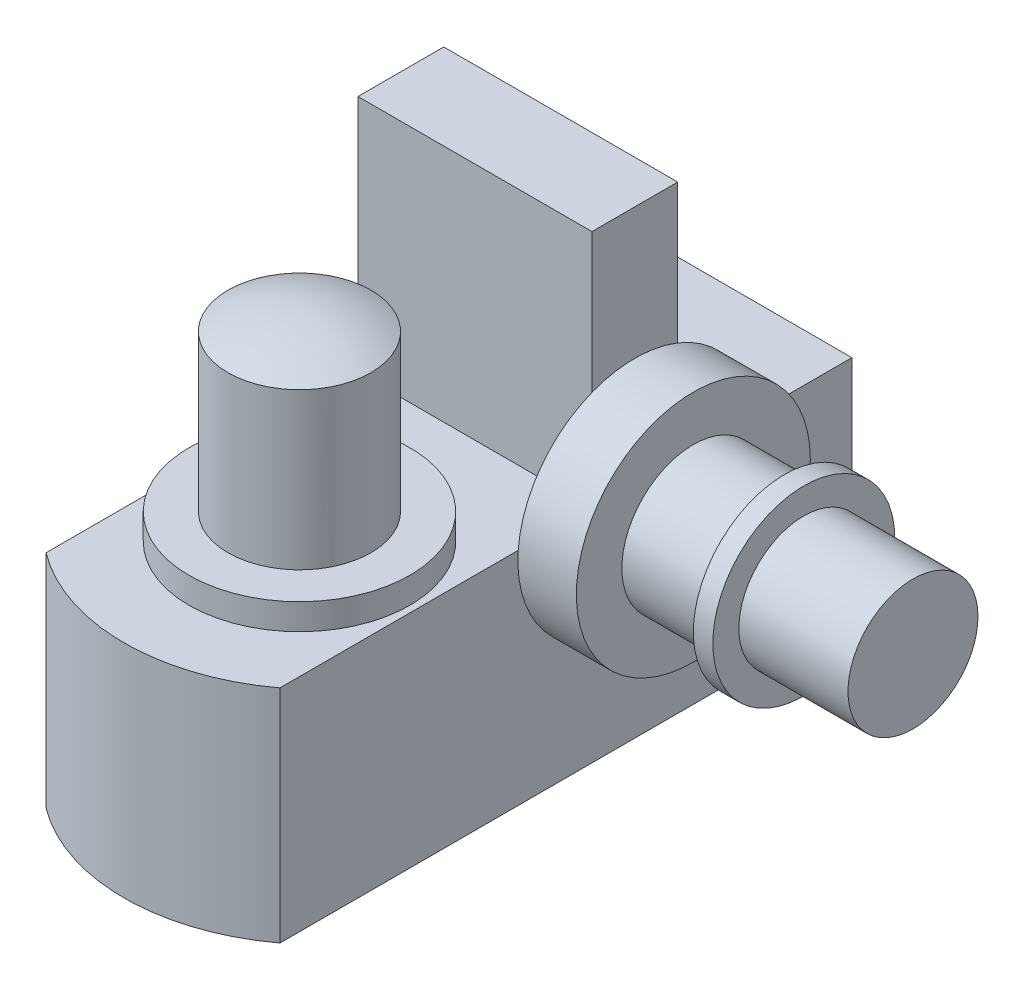
ISO-10303-21;
HEADER;
FILE_DESCRIPTION(('STEP AP214'),'2;1');
FILE_NAME('part.step','',(''),(''),'','','');
FILE_SCHEMA(('AUTOMOTIVE_DESIGN { 1 0 10303 214 1 1 1 1 }'));
ENDSEC;
DATA;
#1=APPLICATION_CONTEXT('core data for automotive mechanical design processes');
#2=APPLICATION_PROTOCOL_DEFINITION('international standard','automotive_design',2000,#1);
#3=PRODUCT_CONTEXT('',#1,'mechanical');
#4=PRODUCT('Part','Part','',(#3));
#5=PRODUCT_RELATED_PRODUCT_CATEGORY('part','',(#4));
#6=PRODUCT_DEFINITION_FORMATION('','',#4);
#7=PRODUCT_DEFINITION_CONTEXT('part definition',#1,'design');
#8=PRODUCT_DEFINITION('design','',#6,#7);
#9=PRODUCT_DEFINITION_SHAPE('','',#8);
#10=(LENGTH_UNIT() NAMED_UNIT(*) SI_UNIT(.MILLI.,.METRE.));
#11=(NAMED_UNIT(*) PLANE_ANGLE_UNIT() SI_UNIT($,.RADIAN.));
#12=(NAMED_UNIT(*) SI_UNIT($,.STERADIAN.) SOLID_ANGLE_UNIT());
#13=UNCERTAINTY_MEASURE_WITH_UNIT(LENGTH_MEASURE(1.E-05),#10,'distance_accuracy_value','');
#14=(GEOMETRIC_REPRESENTATION_CONTEXT(3) GLOBAL_UNCERTAINTY_ASSIGNED_CONTEXT((#13)) GLOBAL_UNIT_ASSIGNED_CONTEXT((#10,
#11,#12)) REPRESENTATION_CONTEXT('',''));
#15=CARTESIAN_POINT('',(0.,0.,0.));
#16=DIRECTION('',(0.,0.,1.));
#17=DIRECTION('',(1.,0.,0.));
#18=AXIS2_PLACEMENT_3D('',#15,#16,#17);
#19=CARTESIAN_POINT('',(45.,42.5,-59.9999999999999));
#20=DIRECTION('',(-1.,0.,0.));
#21=DIRECTION('',(0.,0.,1.));
#22=AXIS2_PLACEMENT_3D('',#19,#20,#21);
#23=PLANE('',#22);
#24=CARTESIAN_POINT('',(45.,39.0521144357626,-76.5000000000001));
#25=DIRECTION('',(1.,0.,0.));
#26=DIRECTION('',(0.,0.,-1.));
#27=AXIS2_PLACEMENT_3D('',#24,#25,#26);
#28=CIRCLE('',#27,45.);
#29=CARTESIAN_POINT('',(45.,80.9179716466211,-93.0000000000001));
#30=VERTEX_POINT('',#29);
#31=CARTESIAN_POINT('',(45.,80.9179716466211,-60.0000000000001));
#32=VERTEX_POINT('',#31);
#33=EDGE_CURVE('E150',#30,#32,#28,.T.);
#34=ORIENTED_EDGE('',*,*,#33,.F.);
#35=DIRECTION('',(0.,-1.,0.));
#36=VECTOR('',#35,1.);
#37=CARTESIAN_POINT('',(45.,134.5,-93.0000000000001));
#38=LINE('',#37,#36);
#39=CARTESIAN_POINT('',(45.,134.5,-93.0000000000001));
#40=VERTEX_POINT('',#39);
#41=EDGE_CURVE('E180',#40,#30,#38,.T.);
#42=ORIENTED_EDGE('',*,*,#41,.F.);
#43=DIRECTION('',(0.,0.,-1.));
#44=VECTOR('',#43,1.);
#45=CARTESIAN_POINT('',(45.,134.5,-93.0000000000001));
#46=LINE('',#45,#44);
#47=CARTESIAN_POINT('',(45.,134.5,-60.0000000000001));
#48=VERTEX_POINT('',#47);
#49=EDGE_CURVE('E161',#48,#40,#46,.T.);
#50=ORIENTED_EDGE('',*,*,#49,.F.);
#51=DIRECTION('',(0.,-1.,0.));
#52=VECTOR('',#51,1.);
#53=CARTESIAN_POINT('',(45.,134.5,-60.0000000000001));
#54=LINE('',#53,#52);
#55=EDGE_CURVE('E173',#48,#32,#54,.T.);
#56=ORIENTED_EDGE('',*,*,#55,.T.);
#57=EDGE_LOOP('',(#34,#42,#50,#56));
#58=FACE_BOUND('',#57,.T.);
#59=ADVANCED_FACE('F43',(#58),#23,.F.);
#60=CARTESIAN_POINT('',(0.,42.5,0.));
#61=DIRECTION('',(0.,1.,0.));
#62=DIRECTION('',(0.,0.,1.));
#63=AXIS2_PLACEMENT_3D('',#60,#61,#62);
#64=PLANE('',#63);
#65=DIRECTION('',(0.,0.,1.));
#66=VECTOR('',#65,1.);
#67=CARTESIAN_POINT('',(-45.,42.5,-59.9999999999999));
#68=LINE('',#67,#66);
#69=CARTESIAN_POINT('',(-45.,42.5,-160.));
#70=VERTEX_POINT('',#69);
#71=CARTESIAN_POINT('',(-45.,42.5,-93.0000000000001));
#72=VERTEX_POINT('',#71);
#73=EDGE_CURVE('E201',#70,#72,#68,.T.);
#74=ORIENTED_EDGE('',*,*,#73,.T.);
#75=DIRECTION('',(-1.,0.,0.));
#76=VECTOR('',#75,1.);
#77=CARTESIAN_POINT('',(-45.,42.5,-93.0000000000001));
#78=LINE('',#77,#76);
#79=CARTESIAN_POINT('',(45.,42.5,-93.0000000000001));
#80=VERTEX_POINT('',#79);
#81=EDGE_CURVE('E130',#80,#72,#78,.T.);
#82=ORIENTED_EDGE('',*,*,#81,.F.);
#83=DIRECTION('',(0.,0.,-1.));
#84=VECTOR('',#83,1.);
#85=CARTESIAN_POINT('',(45.,42.5,59.9999999999999));
#86=LINE('',#85,#84);
#87=CARTESIAN_POINT('',(45.,42.5,-121.367717627888));
#88=VERTEX_POINT('',#87);
#89=EDGE_CURVE('E125',#80,#88,#86,.T.);
#90=ORIENTED_EDGE('',*,*,#89,.T.);
#91=CARTESIAN_POINT('',(45.,42.5,-160.));
#92=VERTEX_POINT('',#91);
#93=EDGE_CURVE('E128',#88,#92,#86,.T.);
#94=ORIENTED_EDGE('',*,*,#93,.T.);
#95=DIRECTION('',(-1.,0.,0.));
#96=VECTOR('',#95,1.);
#97=CARTESIAN_POINT('',(-45.,42.5,-160.));
#98=LINE('',#97,#96);
#99=EDGE_CURVE('E198',#92,#70,#98,.T.);
#100=ORIENTED_EDGE('',*,*,#99,.T.);
#101=EDGE_LOOP('',(#74,#82,#90,#94,#100));
#102=FACE_BOUND('',#101,.T.);
#103=ADVANCED_FACE('F127',(#102),#64,.T.);
#104=CARTESIAN_POINT('',(0.,42.5,7.49999999999992));
#105=DIRECTION('',(0.,1.,0.));
#106=DIRECTION('',(0.,0.,1.));
#107=AXIS2_PLACEMENT_3D('',#104,#105,#106);
#108=CIRCLE('',#107,42.5);
#109=CARTESIAN_POINT('',(0.,42.5,50.));
#110=VERTEX_POINT('',#109);
#111=EDGE_CURVE('E189',#110,#110,#108,.T.);
#112=ORIENTED_EDGE('',*,*,#111,.F.);
#113=EDGE_LOOP('',(#112));
#114=FACE_BOUND('',#113,.T.);
#115=CARTESIAN_POINT('',(45.,42.5,59.9999999999999));
#116=VERTEX_POINT('',#115);
#117=CARTESIAN_POINT('',(45.,42.5,-31.6322823721118));
#118=VERTEX_POINT('',#117);
#119=EDGE_CURVE('E136',#116,#118,#86,.T.);
#120=ORIENTED_EDGE('',*,*,#119,.T.);
#121=CARTESIAN_POINT('',(45.,42.5,-60.0000000000001));
#122=VERTEX_POINT('',#121);
#123=EDGE_CURVE('E134',#118,#122,#86,.T.);
#124=ORIENTED_EDGE('',*,*,#123,.T.);
#125=DIRECTION('',(1.,0.,0.));
#126=VECTOR('',#125,1.);
#127=CARTESIAN_POINT('',(-45.,42.5,-60.0000000000001));
#128=LINE('',#127,#126);
#129=CARTESIAN_POINT('',(-45.,42.5,-60.0000000000001));
#130=VERTEX_POINT('',#129);
#131=EDGE_CURVE('E165',#130,#122,#128,.T.);
#132=ORIENTED_EDGE('',*,*,#131,.F.);
#133=CARTESIAN_POINT('',(-45.,42.5,59.9999999999999));
#134=VERTEX_POINT('',#133);
#135=EDGE_CURVE('E200',#130,#134,#68,.T.);
#136=ORIENTED_EDGE('',*,*,#135,.T.);
#137=CARTESIAN_POINT('',(0.,42.5,0.));
#138=DIRECTION('',(0.,1.,0.));
#139=DIRECTION('',(0.,0.,1.));
#140=AXIS2_PLACEMENT_3D('',#137,#138,#139);
#141=CIRCLE('',#140,74.9999999999999);
#142=EDGE_CURVE('E141',#134,#116,#141,.T.);
#143=ORIENTED_EDGE('',*,*,#142,.T.);
#144=EDGE_LOOP('',(#120,#124,#132,#136,#143));
#145=FACE_BOUND('',#144,.T.);
#146=ADVANCED_FACE('F286',(#114,#145),#64,.T.);
#147=CARTESIAN_POINT('',(0.,42.5,0.));
#148=DIRECTION('',(0.,-1.,0.));
#149=DIRECTION('',(0.,0.,-1.));
#150=AXIS2_PLACEMENT_3D('',#147,#148,#149);
#151=CYLINDRICAL_SURFACE('',#150,74.9999999999999);
#152=CARTESIAN_POINT('',(0.,-42.5,0.));
#153=DIRECTION('',(0.,1.,0.));
#154=DIRECTION('',(0.,0.,1.));
#155=AXIS2_PLACEMENT_3D('',#152,#153,#154);
#156=CIRCLE('',#155,74.9999999999999);
#157=CARTESIAN_POINT('',(-45.,-42.5,59.9999999999999));
#158=VERTEX_POINT('',#157);
#159=CARTESIAN_POINT('',(45.,-42.5,59.9999999999999));
#160=VERTEX_POINT('',#159);
#161=EDGE_CURVE('E192',#158,#160,#156,.T.);
#162=ORIENTED_EDGE('',*,*,#161,.T.);
#163=DIRECTION('',(0.,-1.,0.));
#164=VECTOR('',#163,1.);
#165=CARTESIAN_POINT('',(45.,42.5,59.9999999999999));
#166=LINE('',#165,#164);
#167=EDGE_CURVE('E47',#116,#160,#166,.T.);
#168=ORIENTED_EDGE('',*,*,#167,.F.);
#169=ORIENTED_EDGE('',*,*,#142,.F.);
#170=DIRECTION('',(0.,-1.,0.));
#171=VECTOR('',#170,1.);
#172=CARTESIAN_POINT('',(-45.,42.5,59.9999999999999));
#173=LINE('',#172,#171);
#174=EDGE_CURVE('E203',#134,#158,#173,.T.);
#175=ORIENTED_EDGE('',*,*,#174,.T.);
#176=EDGE_LOOP('',(#162,#168,#169,#175));
#177=FACE_BOUND('',#176,.T.);
#178=ADVANCED_FACE('F45',(#177),#151,.T.);
#179=EDGE_CURVE('E60',#118,#88,#28,.T.);
#180=ORIENTED_EDGE('',*,*,#179,.F.);
#181=ORIENTED_EDGE('',*,*,#119,.F.);
#182=ORIENTED_EDGE('',*,*,#167,.T.);
#183=DIRECTION('',(0.,0.,-1.));
#184=VECTOR('',#183,1.);
#185=CARTESIAN_POINT('',(45.,-42.5,-59.9999999999999));
#186=LINE('',#185,#184);
#187=CARTESIAN_POINT('',(45.,-42.5,-160.));
#188=VERTEX_POINT('',#187);
#189=EDGE_CURVE('E206',#160,#188,#186,.T.);
#190=ORIENTED_EDGE('',*,*,#189,.T.);
#191=DIRECTION('',(0.,-1.,0.));
#192=VECTOR('',#191,1.);
#193=CARTESIAN_POINT('',(45.,42.5,-160.));
#194=LINE('',#193,#192);
#195=EDGE_CURVE('E139',#92,#188,#194,.T.);
#196=ORIENTED_EDGE('',*,*,#195,.F.);
#197=ORIENTED_EDGE('',*,*,#93,.F.);
#198=EDGE_LOOP('',(#180,#181,#182,#190,#196,#197));
#199=FACE_BOUND('',#198,.T.);
#200=ADVANCED_FACE('F137',(#199),#23,.F.);
#201=CARTESIAN_POINT('',(-45.,42.5,-160.));
#202=DIRECTION('',(0.,0.,1.));
#203=DIRECTION('',(1.,0.,0.));
#204=AXIS2_PLACEMENT_3D('',#201,#202,#203);
#205=PLANE('',#204);
#206=DIRECTION('',(-1.,0.,0.));
#207=VECTOR('',#206,1.);
#208=CARTESIAN_POINT('',(-45.,-42.5,-160.));
#209=LINE('',#208,#207);
#210=CARTESIAN_POINT('',(-45.,-42.5,-160.));
#211=VERTEX_POINT('',#210);
#212=EDGE_CURVE('E208',#188,#211,#209,.T.);
#213=ORIENTED_EDGE('',*,*,#212,.T.);
#214=DIRECTION('',(0.,-1.,0.));
#215=VECTOR('',#214,1.);
#216=CARTESIAN_POINT('',(-45.,42.5,-160.));
#217=LINE('',#216,#215);
#218=EDGE_CURVE('E214',#70,#211,#217,.T.);
#219=ORIENTED_EDGE('',*,*,#218,.F.);
#220=ORIENTED_EDGE('',*,*,#99,.F.);
#221=ORIENTED_EDGE('',*,*,#195,.T.);
#222=EDGE_LOOP('',(#213,#219,#220,#221));
#223=FACE_BOUND('',#222,.T.);
#224=ADVANCED_FACE('F227',(#223),#205,.F.);
#225=CARTESIAN_POINT('',(-45.,42.5,59.9999999999999));
#226=DIRECTION('',(1.,0.,0.));
#227=DIRECTION('',(0.,0.,-1.));
#228=AXIS2_PLACEMENT_3D('',#225,#226,#227);
#229=PLANE('',#228);
#230=DIRECTION('',(0.,0.,1.));
#231=VECTOR('',#230,1.);
#232=CARTESIAN_POINT('',(-45.,-42.5,59.9999999999999));
#233=LINE('',#232,#231);
#234=EDGE_CURVE('E196',#211,#158,#233,.T.);
#235=ORIENTED_EDGE('',*,*,#234,.T.);
#236=ORIENTED_EDGE('',*,*,#174,.F.);
#237=ORIENTED_EDGE('',*,*,#135,.F.);
#238=DIRECTION('',(0.,-1.,0.));
#239=VECTOR('',#238,1.);
#240=CARTESIAN_POINT('',(-45.,134.5,-60.0000000000001));
#241=LINE('',#240,#239);
#242=CARTESIAN_POINT('',(-45.,134.5,-60.0000000000001));
#243=VERTEX_POINT('',#242);
#244=EDGE_CURVE('E175',#243,#130,#241,.T.);
#245=ORIENTED_EDGE('',*,*,#244,.F.);
#246=DIRECTION('',(0.,0.,1.));
#247=VECTOR('',#246,1.);
#248=CARTESIAN_POINT('',(-45.,134.5,-93.0000000000001));
#249=LINE('',#248,#247);
#250=CARTESIAN_POINT('',(-45.,134.5,-93.0000000000001));
#251=VERTEX_POINT('',#250);
#252=EDGE_CURVE('E167',#251,#243,#249,.T.);
#253=ORIENTED_EDGE('',*,*,#252,.F.);
#254=DIRECTION('',(0.,-1.,0.));
#255=VECTOR('',#254,1.);
#256=CARTESIAN_POINT('',(-45.,134.5,-93.0000000000001));
#257=LINE('',#256,#255);
#258=EDGE_CURVE('E177',#251,#72,#257,.T.);
#259=ORIENTED_EDGE('',*,*,#258,.T.);
#260=ORIENTED_EDGE('',*,*,#73,.F.);
#261=ORIENTED_EDGE('',*,*,#218,.T.);
#262=EDGE_LOOP('',(#235,#236,#237,#245,#253,#259,#260,#261));
#263=FACE_BOUND('',#262,.T.);
#264=ADVANCED_FACE('F230',(#263),#229,.F.);
#265=CARTESIAN_POINT('',(0.,-42.5,0.));
#266=DIRECTION('',(0.,1.,0.));
#267=DIRECTION('',(0.,0.,1.));
#268=AXIS2_PLACEMENT_3D('',#265,#266,#267);
#269=PLANE('',#268);
#270=ORIENTED_EDGE('',*,*,#161,.F.);
#271=ORIENTED_EDGE('',*,*,#234,.F.);
#272=ORIENTED_EDGE('',*,*,#212,.F.);
#273=ORIENTED_EDGE('',*,*,#189,.F.);
#274=EDGE_LOOP('',(#270,#271,#272,#273));
#275=FACE_BOUND('',#274,.T.);
#276=ADVANCED_FACE('F225',(#275),#269,.F.);
#277=CARTESIAN_POINT('',(0.,52.5,7.49999999999992));
#278=DIRECTION('',(0.,-1.,0.));
#279=DIRECTION('',(0.,0.,-1.));
#280=AXIS2_PLACEMENT_3D('',#277,#278,#279);
#281=CYLINDRICAL_SURFACE('',#280,42.5);
#282=CARTESIAN_POINT('',(0.,52.5,7.49999999999992));
#283=DIRECTION('',(0.,1.,0.));
#284=DIRECTION('',(0.,0.,1.));
#285=AXIS2_PLACEMENT_3D('',#282,#283,#284);
#286=CIRCLE('',#285,42.5);
#287=CARTESIAN_POINT('',(0.,52.5,50.));
#288=VERTEX_POINT('',#287);
#289=EDGE_CURVE('E186',#288,#288,#286,.T.);
#290=ORIENTED_EDGE('',*,*,#289,.F.);
#291=EDGE_LOOP('',(#290));
#292=FACE_BOUND('',#291,.T.);
#293=ORIENTED_EDGE('',*,*,#111,.T.);
#294=EDGE_LOOP('',(#293));
#295=FACE_BOUND('',#294,.T.);
#296=ADVANCED_FACE('F304',(#292,#295),#281,.T.);
#297=CARTESIAN_POINT('',(0.,52.5,7.49999999999992));
#298=DIRECTION('',(0.,1.,0.));
#299=DIRECTION('',(0.,0.,1.));
#300=AXIS2_PLACEMENT_3D('',#297,#298,#299);
#301=PLANE('',#300);
#302=CARTESIAN_POINT('',(0.,52.5,7.49999999999992));
#303=DIRECTION('',(0.,1.,0.));
#304=DIRECTION('',(0.,0.,1.));
#305=AXIS2_PLACEMENT_3D('',#302,#303,#304);
#306=CIRCLE('',#305,27.5);
#307=CARTESIAN_POINT('',(0.,52.5,34.9999999999999));
#308=VERTEX_POINT('',#307);
#309=EDGE_CURVE('E151',#308,#308,#306,.T.);
#310=ORIENTED_EDGE('',*,*,#309,.F.);
#311=EDGE_LOOP('',(#310));
#312=FACE_BOUND('',#311,.T.);
#313=ORIENTED_EDGE('',*,*,#289,.T.);
#314=EDGE_LOOP('',(#313));
#315=FACE_BOUND('',#314,.T.);
#316=ADVANCED_FACE('F323',(#312,#315),#301,.T.);
#317=CARTESIAN_POINT('',(0.,112.5,7.49999999999992));
#318=DIRECTION('',(0.,-1.,0.));
#319=DIRECTION('',(0.,0.,-1.));
#320=AXIS2_PLACEMENT_3D('',#317,#318,#319);
#321=CYLINDRICAL_SURFACE('',#320,27.5);
#322=CARTESIAN_POINT('',(0.,112.5,7.49999999999992));
#323=DIRECTION('',(0.,1.,0.));
#324=DIRECTION('',(0.,0.,1.));
#325=AXIS2_PLACEMENT_3D('',#322,#323,#324);
#326=CIRCLE('',#325,27.5);
#327=CARTESIAN_POINT('',(0.,112.5,34.9999999999999));
#328=VERTEX_POINT('',#327);
#329=EDGE_CURVE('E183',#328,#328,#326,.T.);
#330=ORIENTED_EDGE('',*,*,#329,.F.);
#331=EDGE_LOOP('',(#330));
#332=FACE_BOUND('',#331,.T.);
#333=ORIENTED_EDGE('',*,*,#309,.T.);
#334=EDGE_LOOP('',(#333));
#335=FACE_BOUND('',#334,.T.);
#336=ADVANCED_FACE('F330',(#332,#335),#321,.T.);
#337=CARTESIAN_POINT('',(0.,59.1731774807462,7.49999999999992));
#338=DIRECTION('',(0.,-1.,0.));
#339=DIRECTION('',(0.,0.,-1.));
#340=AXIS2_PLACEMENT_3D('',#337,#338,#339);
#341=SPHERICAL_SURFACE('',#340,60.);
#342=ORIENTED_EDGE('',*,*,#329,.T.);
#343=EDGE_LOOP('',(#342));
#344=FACE_BOUND('',#343,.T.);
#345=ADVANCED_FACE('F337',(#344),#341,.T.);
#346=CARTESIAN_POINT('',(-45.,134.5,-93.0000000000001));
#347=DIRECTION('',(0.,0.,1.));
#348=DIRECTION('',(1.,0.,0.));
#349=AXIS2_PLACEMENT_3D('',#346,#347,#348);
#350=PLANE('',#349);
#351=ORIENTED_EDGE('',*,*,#81,.T.);
#352=ORIENTED_EDGE('',*,*,#258,.F.);
#353=DIRECTION('',(-1.,0.,0.));
#354=VECTOR('',#353,1.);
#355=CARTESIAN_POINT('',(-45.,134.5,-93.0000000000001));
#356=LINE('',#355,#354);
#357=EDGE_CURVE('E164',#40,#251,#356,.T.);
#358=ORIENTED_EDGE('',*,*,#357,.F.);
#359=ORIENTED_EDGE('',*,*,#41,.T.);
#360=EDGE_CURVE('E154',#30,#80,#38,.T.);
#361=ORIENTED_EDGE('',*,*,#360,.T.);
#362=EDGE_LOOP('',(#351,#352,#358,#359,#361));
#363=FACE_BOUND('',#362,.T.);
#364=ADVANCED_FACE('F235',(#363),#350,.F.);
#365=CARTESIAN_POINT('',(-45.,134.5,-60.0000000000001));
#366=DIRECTION('',(0.,0.,-1.));
#367=DIRECTION('',(-1.,0.,0.));
#368=AXIS2_PLACEMENT_3D('',#365,#366,#367);
#369=PLANE('',#368);
#370=ORIENTED_EDGE('',*,*,#131,.T.);
#371=EDGE_CURVE('E68',#32,#122,#54,.T.);
#372=ORIENTED_EDGE('',*,*,#371,.F.);
#373=ORIENTED_EDGE('',*,*,#55,.F.);
#374=DIRECTION('',(1.,0.,0.));
#375=VECTOR('',#374,1.);
#376=CARTESIAN_POINT('',(-45.,134.5,-60.0000000000001));
#377=LINE('',#376,#375);
#378=EDGE_CURVE('E169',#243,#48,#377,.T.);
#379=ORIENTED_EDGE('',*,*,#378,.F.);
#380=ORIENTED_EDGE('',*,*,#244,.T.);
#381=EDGE_LOOP('',(#370,#372,#373,#379,#380));
#382=FACE_BOUND('',#381,.T.);
#383=ADVANCED_FACE('F352',(#382),#369,.F.);
#384=CARTESIAN_POINT('',(0.,134.5,0.));
#385=DIRECTION('',(0.,1.,0.));
#386=DIRECTION('',(0.,0.,1.));
#387=AXIS2_PLACEMENT_3D('',#384,#385,#386);
#388=PLANE('',#387);
#389=ORIENTED_EDGE('',*,*,#49,.T.);
#390=ORIENTED_EDGE('',*,*,#357,.T.);
#391=ORIENTED_EDGE('',*,*,#252,.T.);
#392=ORIENTED_EDGE('',*,*,#378,.T.);
#393=EDGE_LOOP('',(#389,#390,#391,#392));
#394=FACE_BOUND('',#393,.T.);
#395=ADVANCED_FACE('F359',(#394),#388,.T.);
#396=CARTESIAN_POINT('',(45.,39.0521144357626,-76.5000000000001));
#397=DIRECTION('',(1.,0.,0.));
#398=DIRECTION('',(0.,0.,-1.));
#399=AXIS2_PLACEMENT_3D('',#396,#397,#398);
#400=PLANE('',#399);
#401=EDGE_CURVE('E149',#32,#118,#28,.T.);
#402=ORIENTED_EDGE('',*,*,#401,.F.);
#403=ORIENTED_EDGE('',*,*,#371,.T.);
#404=ORIENTED_EDGE('',*,*,#123,.F.);
#405=EDGE_LOOP('',(#402,#403,#404));
#406=FACE_BOUND('',#405,.T.);
#407=ADVANCED_FACE('F365',(#406),#400,.F.);
#408=CARTESIAN_POINT('',(67.5,39.0521144357626,-76.5000000000001));
#409=DIRECTION('',(-1.,0.,0.));
#410=DIRECTION('',(0.,0.,1.));
#411=AXIS2_PLACEMENT_3D('',#408,#409,#410);
#412=CYLINDRICAL_SURFACE('',#411,45.);
#413=CARTESIAN_POINT('',(67.5,39.0521144357626,-76.5000000000001));
#414=DIRECTION('',(1.,0.,0.));
#415=DIRECTION('',(0.,0.,-1.));
#416=AXIS2_PLACEMENT_3D('',#413,#414,#415);
#417=CIRCLE('',#416,45.);
#418=CARTESIAN_POINT('',(67.5,39.0521144357626,-121.5));
#419=VERTEX_POINT('',#418);
#420=EDGE_CURVE('E155',#419,#419,#417,.T.);
#421=ORIENTED_EDGE('',*,*,#420,.F.);
#422=EDGE_LOOP('',(#421));
#423=FACE_BOUND('',#422,.T.);
#424=EDGE_CURVE('E147',#88,#30,#28,.T.);
#425=ORIENTED_EDGE('',*,*,#424,.T.);
#426=ORIENTED_EDGE('',*,*,#33,.T.);
#427=ORIENTED_EDGE('',*,*,#401,.T.);
#428=ORIENTED_EDGE('',*,*,#179,.T.);
#429=EDGE_LOOP('',(#425,#426,#427,#428));
#430=FACE_BOUND('',#429,.T.);
#431=ADVANCED_FACE('F145',(#423,#430),#412,.T.);
#432=CARTESIAN_POINT('',(67.5,39.0521144357626,-76.5000000000001));
#433=DIRECTION('',(1.,0.,0.));
#434=DIRECTION('',(0.,0.,-1.));
#435=AXIS2_PLACEMENT_3D('',#432,#433,#434);
#436=PLANE('',#435);
#437=CARTESIAN_POINT('',(67.5,39.0521144357626,-76.5000000000001));
#438=DIRECTION('',(1.,0.,0.));
#439=DIRECTION('',(0.,0.,-1.));
#440=AXIS2_PLACEMENT_3D('',#437,#438,#439);
#441=CIRCLE('',#440,27.5);
#442=CARTESIAN_POINT('',(67.5,39.0521144357626,-104.));
#443=VERTEX_POINT('',#442);
#444=EDGE_CURVE('E52',#443,#443,#441,.T.);
#445=ORIENTED_EDGE('',*,*,#444,.F.);
#446=EDGE_LOOP('',(#445));
#447=FACE_BOUND('',#446,.T.);
#448=ORIENTED_EDGE('',*,*,#420,.T.);
#449=EDGE_LOOP('',(#448));
#450=FACE_BOUND('',#449,.T.);
#451=ADVANCED_FACE('F427',(#447,#450),#436,.T.);
#452=ORIENTED_EDGE('',*,*,#89,.F.);
#453=ORIENTED_EDGE('',*,*,#360,.F.);
#454=ORIENTED_EDGE('',*,*,#424,.F.);
#455=EDGE_LOOP('',(#452,#453,#454));
#456=FACE_BOUND('',#455,.T.);
#457=ADVANCED_FACE('F153',(#456),#400,.F.);
#458=CARTESIAN_POINT('',(102.5,39.0521144357626,-76.5000000000001));
#459=DIRECTION('',(-1.,0.,0.));
#460=DIRECTION('',(0.,0.,1.));
#461=AXIS2_PLACEMENT_3D('',#458,#459,#460);
#462=CYLINDRICAL_SURFACE('',#461,27.5);
#463=CARTESIAN_POINT('',(102.5,39.0521144357626,-76.5000000000001));
#464=DIRECTION('',(1.,0.,0.));
#465=DIRECTION('',(0.,0.,-1.));
#466=AXIS2_PLACEMENT_3D('',#463,#464,#465);
#467=CIRCLE('',#466,27.5);
#468=CARTESIAN_POINT('',(102.5,39.0521144357626,-104.));
#469=VERTEX_POINT('',#468);
#470=EDGE_CURVE('E158',#469,#469,#467,.T.);
#471=ORIENTED_EDGE('',*,*,#470,.F.);
#472=EDGE_LOOP('',(#471));
#473=FACE_BOUND('',#472,.T.);
#474=ORIENTED_EDGE('',*,*,#444,.T.);
#475=EDGE_LOOP('',(#474));
#476=FACE_BOUND('',#475,.T.);
#477=ADVANCED_FACE('F273',(#473,#476),#462,.T.);
#478=CARTESIAN_POINT('',(110.,39.0521144357626,-76.5000000000001));
#479=DIRECTION('',(-1.,0.,0.));
#480=DIRECTION('',(0.,0.,1.));
#481=AXIS2_PLACEMENT_3D('',#478,#479,#480);
#482=CYLINDRICAL_SURFACE('',#481,35.);
#483=CARTESIAN_POINT('',(110.,39.0521144357626,-76.5000000000001));
#484=DIRECTION('',(1.,0.,0.));
#485=DIRECTION('',(0.,0.,-1.));
#486=AXIS2_PLACEMENT_3D('',#483,#484,#485);
#487=CIRCLE('',#486,35.);
#488=CARTESIAN_POINT('',(110.,39.0521144357626,-111.5));
#489=VERTEX_POINT('',#488);
#490=EDGE_CURVE('E245',#489,#489,#487,.T.);
#491=ORIENTED_EDGE('',*,*,#490,.F.);
#492=EDGE_LOOP('',(#491));
#493=FACE_BOUND('',#492,.T.);
#494=CARTESIAN_POINT('',(102.5,39.0521144357626,-76.5000000000001));
#495=DIRECTION('',(1.,0.,0.));
#496=DIRECTION('',(0.,0.,-1.));
#497=AXIS2_PLACEMENT_3D('',#494,#495,#496);
#498=CIRCLE('',#497,35.);
#499=CARTESIAN_POINT('',(102.5,39.0521144357626,-111.5));
#500=VERTEX_POINT('',#499);
#501=EDGE_CURVE('E246',#500,#500,#498,.T.);
#502=ORIENTED_EDGE('',*,*,#501,.T.);
#503=EDGE_LOOP('',(#502));
#504=FACE_BOUND('',#503,.T.);
#505=ADVANCED_FACE('F267',(#493,#504),#482,.T.);
#506=CARTESIAN_POINT('',(110.,39.0521144357626,-76.5000000000001));
#507=DIRECTION('',(1.,0.,0.));
#508=DIRECTION('',(0.,0.,-1.));
#509=AXIS2_PLACEMENT_3D('',#506,#507,#508);
#510=PLANE('',#509);
#511=CARTESIAN_POINT('',(110.,39.0521144357626,-76.5000000000001));
#512=DIRECTION('',(1.,0.,0.));
#513=DIRECTION('',(0.,0.,-1.));
#514=AXIS2_PLACEMENT_3D('',#511,#512,#513);
#515=CIRCLE('',#514,25.);
#516=CARTESIAN_POINT('',(110.,39.0521144357626,-101.5));
#517=VERTEX_POINT('',#516);
#518=EDGE_CURVE('E11',#517,#517,#515,.T.);
#519=ORIENTED_EDGE('',*,*,#518,.F.);
#520=EDGE_LOOP('',(#519));
#521=FACE_BOUND('',#520,.T.);
#522=ORIENTED_EDGE('',*,*,#490,.T.);
#523=EDGE_LOOP('',(#522));
#524=FACE_BOUND('',#523,.T.);
#525=ADVANCED_FACE('F264',(#521,#524),#510,.T.);
#526=CARTESIAN_POINT('',(102.5,39.0521144357626,-76.5000000000001));
#527=DIRECTION('',(1.,0.,0.));
#528=DIRECTION('',(0.,0.,-1.));
#529=AXIS2_PLACEMENT_3D('',#526,#527,#528);
#530=PLANE('',#529);
#531=ORIENTED_EDGE('',*,*,#470,.T.);
#532=EDGE_LOOP('',(#531));
#533=FACE_BOUND('',#532,.T.);
#534=ORIENTED_EDGE('',*,*,#501,.F.);
#535=EDGE_LOOP('',(#534));
#536=FACE_BOUND('',#535,.T.);
#537=ADVANCED_FACE('F260',(#533,#536),#530,.F.);
#538=CARTESIAN_POINT('',(152.,39.0521144357626,-76.5000000000001));
#539=DIRECTION('',(-1.,0.,0.));
#540=DIRECTION('',(0.,0.,1.));
#541=AXIS2_PLACEMENT_3D('',#538,#539,#540);
#542=CYLINDRICAL_SURFACE('',#541,25.);
#543=CARTESIAN_POINT('',(152.,39.0521144357626,-76.5000000000001));
#544=DIRECTION('',(1.,0.,0.));
#545=DIRECTION('',(0.,0.,-1.));
#546=AXIS2_PLACEMENT_3D('',#543,#544,#545);
#547=CIRCLE('',#546,25.);
#548=CARTESIAN_POINT('',(152.,39.0521144357626,-101.5));
#549=VERTEX_POINT('',#548);
#550=EDGE_CURVE('E249',#549,#549,#547,.T.);
#551=ORIENTED_EDGE('',*,*,#550,.F.);
#552=EDGE_LOOP('',(#551));
#553=FACE_BOUND('',#552,.T.);
#554=ORIENTED_EDGE('',*,*,#518,.T.);
#555=EDGE_LOOP('',(#554));
#556=FACE_BOUND('',#555,.T.);
#557=ADVANCED_FACE('F257',(#553,#556),#542,.T.);
#558=CARTESIAN_POINT('',(152.,39.0521144357626,-76.5000000000001));
#559=DIRECTION('',(1.,0.,0.));
#560=DIRECTION('',(0.,0.,-1.));
#561=AXIS2_PLACEMENT_3D('',#558,#559,#560);
#562=PLANE('',#561);
#563=ORIENTED_EDGE('',*,*,#550,.T.);
#564=EDGE_LOOP('',(#563));
#565=FACE_BOUND('',#564,.T.);
#566=ADVANCED_FACE('F255',(#565),#562,.T.);
#567=CLOSED_SHELL('',(#59,#103,#146,#178,#200,#224,#264,#276,#296,#316,#336,#345,#364,#383,#395,
#407,#431,#451,#457,#477,#505,#525,#537,#557,#566));
#568=MANIFOLD_SOLID_BREP('B2',#567);
#569=ADVANCED_BREP_SHAPE_REPRESENTATION('',(#18,#568),#14);
#570=SHAPE_DEFINITION_REPRESENTATION(#9,#569);
ENDSEC;
END-ISO-10303-21;
